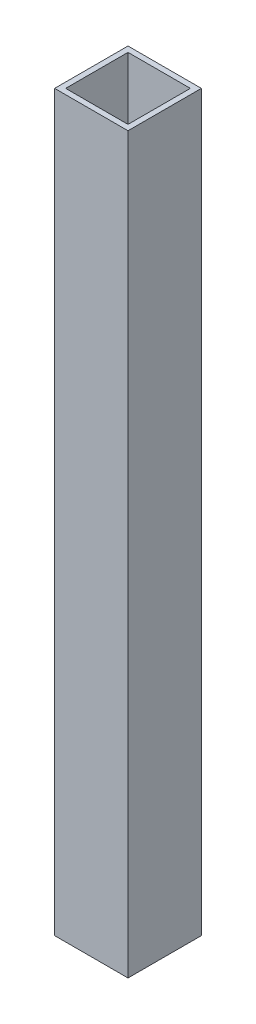
ISO-10303-21;
HEADER;
FILE_DESCRIPTION(('STEP AP214'),'2;1');
FILE_NAME('part.step','',(''),(''),'','','');
FILE_SCHEMA(('AUTOMOTIVE_DESIGN { 1 0 10303 214 1 1 1 1 }'));
ENDSEC;
DATA;
#1=APPLICATION_CONTEXT('core data for automotive mechanical design processes');
#2=APPLICATION_PROTOCOL_DEFINITION('international standard','automotive_design',2000,#1);
#3=PRODUCT_CONTEXT('',#1,'mechanical');
#4=PRODUCT('Part','Part','',(#3));
#5=PRODUCT_RELATED_PRODUCT_CATEGORY('part','',(#4));
#6=PRODUCT_DEFINITION_FORMATION('','',#4);
#7=PRODUCT_DEFINITION_CONTEXT('part definition',#1,'design');
#8=PRODUCT_DEFINITION('design','',#6,#7);
#9=PRODUCT_DEFINITION_SHAPE('','',#8);
#10=(LENGTH_UNIT() NAMED_UNIT(*) SI_UNIT(.MILLI.,.METRE.));
#11=(NAMED_UNIT(*) PLANE_ANGLE_UNIT() SI_UNIT($,.RADIAN.));
#12=(NAMED_UNIT(*) SI_UNIT($,.STERADIAN.) SOLID_ANGLE_UNIT());
#13=UNCERTAINTY_MEASURE_WITH_UNIT(LENGTH_MEASURE(1.E-05),#10,'distance_accuracy_value','');
#14=(GEOMETRIC_REPRESENTATION_CONTEXT(3) GLOBAL_UNCERTAINTY_ASSIGNED_CONTEXT((#13)) GLOBAL_UNIT_ASSIGNED_CONTEXT((#10,
#11,#12)) REPRESENTATION_CONTEXT('',''));
#15=CARTESIAN_POINT('',(0.,0.,0.));
#16=DIRECTION('',(0.,0.,1.));
#17=DIRECTION('',(1.,0.,0.));
#18=AXIS2_PLACEMENT_3D('',#15,#16,#17);
#19=CARTESIAN_POINT('',(-20.,400.,20.));
#20=DIRECTION('',(1.,0.,0.));
#21=DIRECTION('',(0.,0.,-1.));
#22=AXIS2_PLACEMENT_3D('',#19,#20,#21);
#23=PLANE('',#22);
#24=DIRECTION('',(0.,0.,1.));
#25=VECTOR('',#24,1.);
#26=CARTESIAN_POINT('',(-20.,0.,20.));
#27=LINE('',#26,#25);
#28=CARTESIAN_POINT('',(-20.,0.,-20.));
#29=VERTEX_POINT('',#28);
#30=CARTESIAN_POINT('',(-20.,0.,20.));
#31=VERTEX_POINT('',#30);
#32=EDGE_CURVE('E130',#29,#31,#27,.T.);
#33=ORIENTED_EDGE('',*,*,#32,.T.);
#34=DIRECTION('',(0.,-1.,0.));
#35=VECTOR('',#34,1.);
#36=CARTESIAN_POINT('',(-20.,400.,20.));
#37=LINE('',#36,#35);
#38=CARTESIAN_POINT('',(-20.,400.,20.));
#39=VERTEX_POINT('',#38);
#40=EDGE_CURVE('E11',#39,#31,#37,.T.);
#41=ORIENTED_EDGE('',*,*,#40,.F.);
#42=DIRECTION('',(0.,0.,1.));
#43=VECTOR('',#42,1.);
#44=CARTESIAN_POINT('',(-20.,400.,20.));
#45=LINE('',#44,#43);
#46=CARTESIAN_POINT('',(-20.,400.,-20.));
#47=VERTEX_POINT('',#46);
#48=EDGE_CURVE('E134',#47,#39,#45,.T.);
#49=ORIENTED_EDGE('',*,*,#48,.F.);
#50=DIRECTION('',(0.,-1.,0.));
#51=VECTOR('',#50,1.);
#52=CARTESIAN_POINT('',(-20.,400.,-20.));
#53=LINE('',#52,#51);
#54=EDGE_CURVE('E144',#47,#29,#53,.T.);
#55=ORIENTED_EDGE('',*,*,#54,.T.);
#56=EDGE_LOOP('',(#33,#41,#49,#55));
#57=FACE_BOUND('',#56,.T.);
#58=ADVANCED_FACE('F33',(#57),#23,.F.);
#59=CARTESIAN_POINT('',(20.,400.,20.));
#60=DIRECTION('',(0.,0.,-1.));
#61=DIRECTION('',(-1.,0.,0.));
#62=AXIS2_PLACEMENT_3D('',#59,#60,#61);
#63=PLANE('',#62);
#64=DIRECTION('',(1.,0.,0.));
#65=VECTOR('',#64,1.);
#66=CARTESIAN_POINT('',(20.,0.,20.));
#67=LINE('',#66,#65);
#68=CARTESIAN_POINT('',(20.,0.,20.));
#69=VERTEX_POINT('',#68);
#70=EDGE_CURVE('E147',#31,#69,#67,.T.);
#71=ORIENTED_EDGE('',*,*,#70,.T.);
#72=DIRECTION('',(0.,-1.,0.));
#73=VECTOR('',#72,1.);
#74=CARTESIAN_POINT('',(20.,400.,20.));
#75=LINE('',#74,#73);
#76=CARTESIAN_POINT('',(20.,400.,20.));
#77=VERTEX_POINT('',#76);
#78=EDGE_CURVE('E40',#77,#69,#75,.T.);
#79=ORIENTED_EDGE('',*,*,#78,.F.);
#80=DIRECTION('',(1.,0.,0.));
#81=VECTOR('',#80,1.);
#82=CARTESIAN_POINT('',(20.,400.,20.));
#83=LINE('',#82,#81);
#84=EDGE_CURVE('E137',#39,#77,#83,.T.);
#85=ORIENTED_EDGE('',*,*,#84,.F.);
#86=ORIENTED_EDGE('',*,*,#40,.T.);
#87=EDGE_LOOP('',(#71,#79,#85,#86));
#88=FACE_BOUND('',#87,.T.);
#89=ADVANCED_FACE('F175',(#88),#63,.F.);
#90=CARTESIAN_POINT('',(20.,400.,20.));
#91=DIRECTION('',(-1.,0.,0.));
#92=DIRECTION('',(0.,0.,1.));
#93=AXIS2_PLACEMENT_3D('',#90,#91,#92);
#94=PLANE('',#93);
#95=DIRECTION('',(0.,0.,-1.));
#96=VECTOR('',#95,1.);
#97=CARTESIAN_POINT('',(20.,0.,20.));
#98=LINE('',#97,#96);
#99=CARTESIAN_POINT('',(20.,0.,-20.));
#100=VERTEX_POINT('',#99);
#101=EDGE_CURVE('E149',#69,#100,#98,.T.);
#102=ORIENTED_EDGE('',*,*,#101,.T.);
#103=DIRECTION('',(0.,-1.,0.));
#104=VECTOR('',#103,1.);
#105=CARTESIAN_POINT('',(20.,400.,-20.));
#106=LINE('',#105,#104);
#107=CARTESIAN_POINT('',(20.,400.,-20.));
#108=VERTEX_POINT('',#107);
#109=EDGE_CURVE('E154',#108,#100,#106,.T.);
#110=ORIENTED_EDGE('',*,*,#109,.F.);
#111=DIRECTION('',(0.,0.,-1.));
#112=VECTOR('',#111,1.);
#113=CARTESIAN_POINT('',(20.,400.,20.));
#114=LINE('',#113,#112);
#115=EDGE_CURVE('E140',#77,#108,#114,.T.);
#116=ORIENTED_EDGE('',*,*,#115,.F.);
#117=ORIENTED_EDGE('',*,*,#78,.T.);
#118=EDGE_LOOP('',(#102,#110,#116,#117));
#119=FACE_BOUND('',#118,.T.);
#120=ADVANCED_FACE('F161',(#119),#94,.F.);
#121=CARTESIAN_POINT('',(20.,400.,-20.));
#122=DIRECTION('',(0.,0.,1.));
#123=DIRECTION('',(1.,0.,0.));
#124=AXIS2_PLACEMENT_3D('',#121,#122,#123);
#125=PLANE('',#124);
#126=DIRECTION('',(-1.,0.,0.));
#127=VECTOR('',#126,1.);
#128=CARTESIAN_POINT('',(20.,0.,-20.));
#129=LINE('',#128,#127);
#130=EDGE_CURVE('E138',#100,#29,#129,.T.);
#131=ORIENTED_EDGE('',*,*,#130,.T.);
#132=ORIENTED_EDGE('',*,*,#54,.F.);
#133=DIRECTION('',(-1.,0.,0.));
#134=VECTOR('',#133,1.);
#135=CARTESIAN_POINT('',(20.,400.,-20.));
#136=LINE('',#135,#134);
#137=EDGE_CURVE('E142',#108,#47,#136,.T.);
#138=ORIENTED_EDGE('',*,*,#137,.F.);
#139=ORIENTED_EDGE('',*,*,#109,.T.);
#140=EDGE_LOOP('',(#131,#132,#138,#139));
#141=FACE_BOUND('',#140,.T.);
#142=ADVANCED_FACE('F168',(#141),#125,.F.);
#143=CARTESIAN_POINT('',(0.,400.,0.));
#144=DIRECTION('',(0.,1.,0.));
#145=DIRECTION('',(0.,0.,1.));
#146=AXIS2_PLACEMENT_3D('',#143,#144,#145);
#147=PLANE('',#146);
#148=DIRECTION('',(1.,0.,0.));
#149=VECTOR('',#148,1.);
#150=CARTESIAN_POINT('',(-17.,400.,17.));
#151=LINE('',#150,#149);
#152=CARTESIAN_POINT('',(-17.,400.,17.));
#153=VERTEX_POINT('',#152);
#154=CARTESIAN_POINT('',(17.,400.,17.));
#155=VERTEX_POINT('',#154);
#156=EDGE_CURVE('E47',#153,#155,#151,.T.);
#157=ORIENTED_EDGE('',*,*,#156,.F.);
#158=DIRECTION('',(0.,0.,1.));
#159=VECTOR('',#158,1.);
#160=CARTESIAN_POINT('',(-17.,400.,-17.));
#161=LINE('',#160,#159);
#162=CARTESIAN_POINT('',(-17.,400.,-17.));
#163=VERTEX_POINT('',#162);
#164=EDGE_CURVE('E115',#163,#153,#161,.T.);
#165=ORIENTED_EDGE('',*,*,#164,.F.);
#166=DIRECTION('',(-1.,0.,0.));
#167=VECTOR('',#166,1.);
#168=CARTESIAN_POINT('',(17.,400.,-17.));
#169=LINE('',#168,#167);
#170=CARTESIAN_POINT('',(17.,400.,-17.));
#171=VERTEX_POINT('',#170);
#172=EDGE_CURVE('E118',#171,#163,#169,.T.);
#173=ORIENTED_EDGE('',*,*,#172,.F.);
#174=DIRECTION('',(0.,0.,-1.));
#175=VECTOR('',#174,1.);
#176=CARTESIAN_POINT('',(17.,400.,17.));
#177=LINE('',#176,#175);
#178=EDGE_CURVE('E124',#155,#171,#177,.T.);
#179=ORIENTED_EDGE('',*,*,#178,.F.);
#180=EDGE_LOOP('',(#157,#165,#173,#179));
#181=FACE_BOUND('',#180,.T.);
#182=ORIENTED_EDGE('',*,*,#48,.T.);
#183=ORIENTED_EDGE('',*,*,#84,.T.);
#184=ORIENTED_EDGE('',*,*,#115,.T.);
#185=ORIENTED_EDGE('',*,*,#137,.T.);
#186=EDGE_LOOP('',(#182,#183,#184,#185));
#187=FACE_BOUND('',#186,.T.);
#188=ADVANCED_FACE('F174',(#181,#187),#147,.T.);
#189=CARTESIAN_POINT('',(0.,0.,0.));
#190=DIRECTION('',(0.,1.,0.));
#191=DIRECTION('',(0.,0.,1.));
#192=AXIS2_PLACEMENT_3D('',#189,#190,#191);
#193=PLANE('',#192);
#194=DIRECTION('',(0.,0.,1.));
#195=VECTOR('',#194,1.);
#196=CARTESIAN_POINT('',(-17.,0.,-17.));
#197=LINE('',#196,#195);
#198=CARTESIAN_POINT('',(-17.,0.,-17.));
#199=VERTEX_POINT('',#198);
#200=CARTESIAN_POINT('',(-17.,0.,17.));
#201=VERTEX_POINT('',#200);
#202=EDGE_CURVE('E105',#199,#201,#197,.T.);
#203=ORIENTED_EDGE('',*,*,#202,.T.);
#204=DIRECTION('',(1.,0.,0.));
#205=VECTOR('',#204,1.);
#206=CARTESIAN_POINT('',(-17.,0.,17.));
#207=LINE('',#206,#205);
#208=CARTESIAN_POINT('',(17.,0.,17.));
#209=VERTEX_POINT('',#208);
#210=EDGE_CURVE('E99',#201,#209,#207,.T.);
#211=ORIENTED_EDGE('',*,*,#210,.T.);
#212=DIRECTION('',(0.,0.,-1.));
#213=VECTOR('',#212,1.);
#214=CARTESIAN_POINT('',(17.,0.,17.));
#215=LINE('',#214,#213);
#216=CARTESIAN_POINT('',(17.,0.,-17.));
#217=VERTEX_POINT('',#216);
#218=EDGE_CURVE('E108',#209,#217,#215,.T.);
#219=ORIENTED_EDGE('',*,*,#218,.T.);
#220=DIRECTION('',(-1.,0.,0.));
#221=VECTOR('',#220,1.);
#222=CARTESIAN_POINT('',(17.,0.,-17.));
#223=LINE('',#222,#221);
#224=EDGE_CURVE('E55',#217,#199,#223,.T.);
#225=ORIENTED_EDGE('',*,*,#224,.T.);
#226=EDGE_LOOP('',(#203,#211,#219,#225));
#227=FACE_BOUND('',#226,.T.);
#228=ORIENTED_EDGE('',*,*,#32,.F.);
#229=ORIENTED_EDGE('',*,*,#130,.F.);
#230=ORIENTED_EDGE('',*,*,#101,.F.);
#231=ORIENTED_EDGE('',*,*,#70,.F.);
#232=EDGE_LOOP('',(#228,#229,#230,#231));
#233=FACE_BOUND('',#232,.T.);
#234=ADVANCED_FACE('F112',(#227,#233),#193,.F.);
#235=CARTESIAN_POINT('',(-17.,0.,17.));
#236=DIRECTION('',(0.,0.,1.));
#237=DIRECTION('',(1.,0.,0.));
#238=AXIS2_PLACEMENT_3D('',#235,#236,#237);
#239=PLANE('',#238);
#240=ORIENTED_EDGE('',*,*,#156,.T.);
#241=DIRECTION('',(0.,1.,0.));
#242=VECTOR('',#241,1.);
#243=CARTESIAN_POINT('',(17.,0.,17.));
#244=LINE('',#243,#242);
#245=EDGE_CURVE('E95',#209,#155,#244,.T.);
#246=ORIENTED_EDGE('',*,*,#245,.F.);
#247=ORIENTED_EDGE('',*,*,#210,.F.);
#248=DIRECTION('',(0.,1.,0.));
#249=VECTOR('',#248,1.);
#250=CARTESIAN_POINT('',(-17.,0.,17.));
#251=LINE('',#250,#249);
#252=EDGE_CURVE('E128',#201,#153,#251,.T.);
#253=ORIENTED_EDGE('',*,*,#252,.T.);
#254=EDGE_LOOP('',(#240,#246,#247,#253));
#255=FACE_BOUND('',#254,.T.);
#256=ADVANCED_FACE('F97',(#255),#239,.F.);
#257=CARTESIAN_POINT('',(-17.,0.,-17.));
#258=DIRECTION('',(-1.,0.,0.));
#259=DIRECTION('',(0.,0.,1.));
#260=AXIS2_PLACEMENT_3D('',#257,#258,#259);
#261=PLANE('',#260);
#262=ORIENTED_EDGE('',*,*,#164,.T.);
#263=ORIENTED_EDGE('',*,*,#252,.F.);
#264=ORIENTED_EDGE('',*,*,#202,.F.);
#265=DIRECTION('',(0.,1.,0.));
#266=VECTOR('',#265,1.);
#267=CARTESIAN_POINT('',(-17.,0.,-17.));
#268=LINE('',#267,#266);
#269=EDGE_CURVE('E131',#199,#163,#268,.T.);
#270=ORIENTED_EDGE('',*,*,#269,.T.);
#271=EDGE_LOOP('',(#262,#263,#264,#270));
#272=FACE_BOUND('',#271,.T.);
#273=ADVANCED_FACE('F192',(#272),#261,.F.);
#274=CARTESIAN_POINT('',(17.,0.,-17.));
#275=DIRECTION('',(0.,0.,-1.));
#276=DIRECTION('',(-1.,0.,0.));
#277=AXIS2_PLACEMENT_3D('',#274,#275,#276);
#278=PLANE('',#277);
#279=ORIENTED_EDGE('',*,*,#172,.T.);
#280=ORIENTED_EDGE('',*,*,#269,.F.);
#281=ORIENTED_EDGE('',*,*,#224,.F.);
#282=DIRECTION('',(0.,1.,0.));
#283=VECTOR('',#282,1.);
#284=CARTESIAN_POINT('',(17.,0.,-17.));
#285=LINE('',#284,#283);
#286=EDGE_CURVE('E104',#217,#171,#285,.T.);
#287=ORIENTED_EDGE('',*,*,#286,.T.);
#288=EDGE_LOOP('',(#279,#280,#281,#287));
#289=FACE_BOUND('',#288,.T.);
#290=ADVANCED_FACE('F195',(#289),#278,.F.);
#291=CARTESIAN_POINT('',(17.,0.,17.));
#292=DIRECTION('',(1.,0.,0.));
#293=DIRECTION('',(0.,0.,-1.));
#294=AXIS2_PLACEMENT_3D('',#291,#292,#293);
#295=PLANE('',#294);
#296=ORIENTED_EDGE('',*,*,#178,.T.);
#297=ORIENTED_EDGE('',*,*,#286,.F.);
#298=ORIENTED_EDGE('',*,*,#218,.F.);
#299=ORIENTED_EDGE('',*,*,#245,.T.);
#300=EDGE_LOOP('',(#296,#297,#298,#299));
#301=FACE_BOUND('',#300,.T.);
#302=ADVANCED_FACE('F109',(#301),#295,.F.);
#303=CLOSED_SHELL('',(#58,#89,#120,#142,#188,#234,#256,#273,#290,#302));
#304=MANIFOLD_SOLID_BREP('B2',#303);
#305=ADVANCED_BREP_SHAPE_REPRESENTATION('',(#18,#304),#14);
#306=SHAPE_DEFINITION_REPRESENTATION(#9,#305);
ENDSEC;
END-ISO-10303-21;
